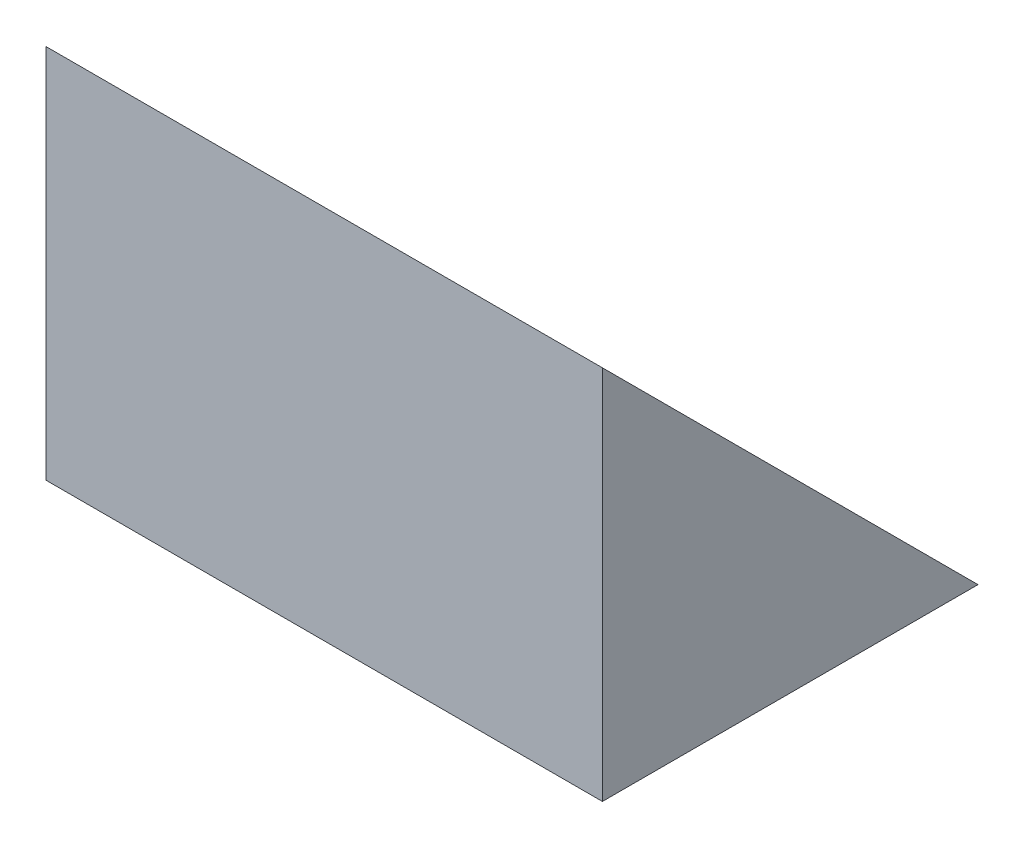
ISO-10303-21;
HEADER;
FILE_DESCRIPTION(('STEP AP214'),'2;1');
FILE_NAME('part.step','',(''),(''),'','','');
FILE_SCHEMA(('AUTOMOTIVE_DESIGN { 1 0 10303 214 1 1 1 1 }'));
ENDSEC;
DATA;
#1=APPLICATION_CONTEXT('core data for automotive mechanical design processes');
#2=APPLICATION_PROTOCOL_DEFINITION('international standard','automotive_design',2000,#1);
#3=PRODUCT_CONTEXT('',#1,'mechanical');
#4=PRODUCT('Part','Part','',(#3));
#5=PRODUCT_RELATED_PRODUCT_CATEGORY('part','',(#4));
#6=PRODUCT_DEFINITION_FORMATION('','',#4);
#7=PRODUCT_DEFINITION_CONTEXT('part definition',#1,'design');
#8=PRODUCT_DEFINITION('design','',#6,#7);
#9=PRODUCT_DEFINITION_SHAPE('','',#8);
#10=(LENGTH_UNIT() NAMED_UNIT(*) SI_UNIT(.MILLI.,.METRE.));
#11=(NAMED_UNIT(*) PLANE_ANGLE_UNIT() SI_UNIT($,.RADIAN.));
#12=(NAMED_UNIT(*) SI_UNIT($,.STERADIAN.) SOLID_ANGLE_UNIT());
#13=UNCERTAINTY_MEASURE_WITH_UNIT(LENGTH_MEASURE(1.E-05),#10,'distance_accuracy_value','');
#14=(GEOMETRIC_REPRESENTATION_CONTEXT(3) GLOBAL_UNCERTAINTY_ASSIGNED_CONTEXT((#13)) GLOBAL_UNIT_ASSIGNED_CONTEXT((#10,
#11,#12)) REPRESENTATION_CONTEXT('',''));
#15=CARTESIAN_POINT('',(0.,0.,0.));
#16=DIRECTION('',(0.,0.,1.));
#17=DIRECTION('',(1.,0.,0.));
#18=AXIS2_PLACEMENT_3D('',#15,#16,#17);
#19=CARTESIAN_POINT('',(0.,0.,0.));
#20=DIRECTION('',(0.,1.,0.));
#21=DIRECTION('',(0.,0.,1.));
#22=AXIS2_PLACEMENT_3D('',#19,#20,#21);
#23=PLANE('',#22);
#24=DIRECTION('',(-0.173648177666923,0.,0.984807753012209));
#25=VECTOR('',#24,1.);
#26=CARTESIAN_POINT('',(-9.78832693761817,0.,-5.44353486096199));
#27=LINE('',#26,#25);
#28=CARTESIAN_POINT('',(-9.78832693761817,0.,-5.44353486096199));
#29=VERTEX_POINT('',#28);
#30=CARTESIAN_POINT('',(-12.433231648245,0.,9.55646513903801));
#31=VERTEX_POINT('',#30);
#32=EDGE_CURVE('E77',#29,#31,#27,.T.);
#33=ORIENTED_EDGE('',*,*,#32,.F.);
#34=DIRECTION('',(1.,0.,0.));
#35=VECTOR('',#34,1.);
#36=CARTESIAN_POINT('',(-9.78832693761817,0.,-5.44353486096199));
#37=LINE('',#36,#35);
#38=CARTESIAN_POINT('',(9.78832693761817,0.,-5.44353486096199));
#39=VERTEX_POINT('',#38);
#40=EDGE_CURVE('E54',#29,#39,#37,.T.);
#41=ORIENTED_EDGE('',*,*,#40,.T.);
#42=DIRECTION('',(0.,0.,1.));
#43=VECTOR('',#42,1.);
#44=CARTESIAN_POINT('',(9.78832693761817,0.,-5.44353486096199));
#45=LINE('',#44,#43);
#46=CARTESIAN_POINT('',(9.78832693761817,0.,9.55646513903801));
#47=VERTEX_POINT('',#46);
#48=EDGE_CURVE('E79',#39,#47,#45,.T.);
#49=ORIENTED_EDGE('',*,*,#48,.T.);
#50=DIRECTION('',(1.,0.,0.));
#51=VECTOR('',#50,1.);
#52=CARTESIAN_POINT('',(-12.433231648245,0.,9.55646513903801));
#53=LINE('',#52,#51);
#54=EDGE_CURVE('E69',#31,#47,#53,.T.);
#55=ORIENTED_EDGE('',*,*,#54,.F.);
#56=EDGE_LOOP('',(#33,#41,#49,#55));
#57=FACE_BOUND('',#56,.T.);
#58=ADVANCED_FACE('F33',(#57),#23,.F.);
#59=CARTESIAN_POINT('',(9.78832693761817,39.8630182987885,-5.44353486096199));
#60=DIRECTION('',(1.,0.,0.));
#61=DIRECTION('',(0.,0.,-1.));
#62=AXIS2_PLACEMENT_3D('',#59,#60,#61);
#63=PLANE('',#62);
#64=DIRECTION('',(0.,-0.707106781186544,-0.707106781186551));
#65=VECTOR('',#64,1.);
#66=CARTESIAN_POINT('',(9.78832693761817,19.9315091493941,14.4879742884323));
#67=LINE('',#66,#65);
#68=CARTESIAN_POINT('',(9.78832693761817,14.9999999999998,9.55646513903801));
#69=VERTEX_POINT('',#68);
#70=EDGE_CURVE('E73',#69,#39,#67,.T.);
#71=ORIENTED_EDGE('',*,*,#70,.F.);
#72=DIRECTION('',(0.,-1.,0.));
#73=VECTOR('',#72,1.);
#74=CARTESIAN_POINT('',(9.78832693761817,39.8630182987885,9.55646513903801));
#75=LINE('',#74,#73);
#76=EDGE_CURVE('E74',#69,#47,#75,.T.);
#77=ORIENTED_EDGE('',*,*,#76,.T.);
#78=ORIENTED_EDGE('',*,*,#48,.F.);
#79=EDGE_LOOP('',(#71,#77,#78));
#80=FACE_BOUND('',#79,.T.);
#81=ADVANCED_FACE('F87',(#80),#63,.T.);
#82=CARTESIAN_POINT('',(-12.433231648245,39.8630182987885,9.55646513903801));
#83=DIRECTION('',(0.,0.,-1.));
#84=DIRECTION('',(-1.,0.,0.));
#85=AXIS2_PLACEMENT_3D('',#82,#83,#84);
#86=PLANE('',#85);
#87=ORIENTED_EDGE('',*,*,#76,.F.);
#88=DIRECTION('',(-1.,0.,0.));
#89=VECTOR('',#88,1.);
#90=CARTESIAN_POINT('',(-12.433231648245,14.9999999999998,9.55646513903801));
#91=LINE('',#90,#89);
#92=CARTESIAN_POINT('',(-12.433231648245,14.9999999999998,9.55646513903801));
#93=VERTEX_POINT('',#92);
#94=EDGE_CURVE('E42',#69,#93,#91,.T.);
#95=ORIENTED_EDGE('',*,*,#94,.T.);
#96=DIRECTION('',(0.,-1.,0.));
#97=VECTOR('',#96,1.);
#98=CARTESIAN_POINT('',(-12.433231648245,39.8630182987885,9.55646513903801));
#99=LINE('',#98,#97);
#100=EDGE_CURVE('E37',#93,#31,#99,.T.);
#101=ORIENTED_EDGE('',*,*,#100,.T.);
#102=ORIENTED_EDGE('',*,*,#54,.T.);
#103=EDGE_LOOP('',(#87,#95,#101,#102));
#104=FACE_BOUND('',#103,.T.);
#105=ADVANCED_FACE('F68',(#104),#86,.F.);
#106=CARTESIAN_POINT('',(-9.78832693761817,39.8630182987885,-5.44353486096199));
#107=DIRECTION('',(0.984807753012209,0.,0.173648177666923));
#108=DIRECTION('',(0.173648177666923,0.,-0.984807753012209));
#109=AXIS2_PLACEMENT_3D('',#106,#107,#108);
#110=PLANE('',#109);
#111=ORIENTED_EDGE('',*,*,#100,.F.);
#112=DIRECTION('',(0.123724030206479,-0.70167384315986,-0.701673843159868));
#113=VECTOR('',#112,1.);
#114=CARTESIAN_POINT('',(-13.248991650396,19.6264048693699,14.1828700084081));
#115=LINE('',#114,#113);
#116=EDGE_CURVE('E11',#93,#29,#115,.T.);
#117=ORIENTED_EDGE('',*,*,#116,.T.);
#118=ORIENTED_EDGE('',*,*,#32,.T.);
#119=EDGE_LOOP('',(#111,#117,#118));
#120=FACE_BOUND('',#119,.T.);
#121=ADVANCED_FACE('F35',(#120),#110,.F.);
#122=CARTESIAN_POINT('',(0.,2.721767430481,-2.72176743048097));
#123=DIRECTION('',(0.,-0.707106781186551,0.707106781186544));
#124=DIRECTION('',(0.,-0.707106781186544,-0.707106781186551));
#125=AXIS2_PLACEMENT_3D('',#122,#123,#124);
#126=PLANE('',#125);
#127=ORIENTED_EDGE('',*,*,#94,.F.);
#128=ORIENTED_EDGE('',*,*,#70,.T.);
#129=ORIENTED_EDGE('',*,*,#40,.F.);
#130=ORIENTED_EDGE('',*,*,#116,.F.);
#131=EDGE_LOOP('',(#127,#128,#129,#130));
#132=FACE_BOUND('',#131,.T.);
#133=ADVANCED_FACE('F89',(#132),#126,.F.);
#134=CLOSED_SHELL('',(#58,#81,#105,#121,#133));
#135=MANIFOLD_SOLID_BREP('B2',#134);
#136=ADVANCED_BREP_SHAPE_REPRESENTATION('',(#18,#135),#14);
#137=SHAPE_DEFINITION_REPRESENTATION(#9,#136);
ENDSEC;
END-ISO-10303-21;
